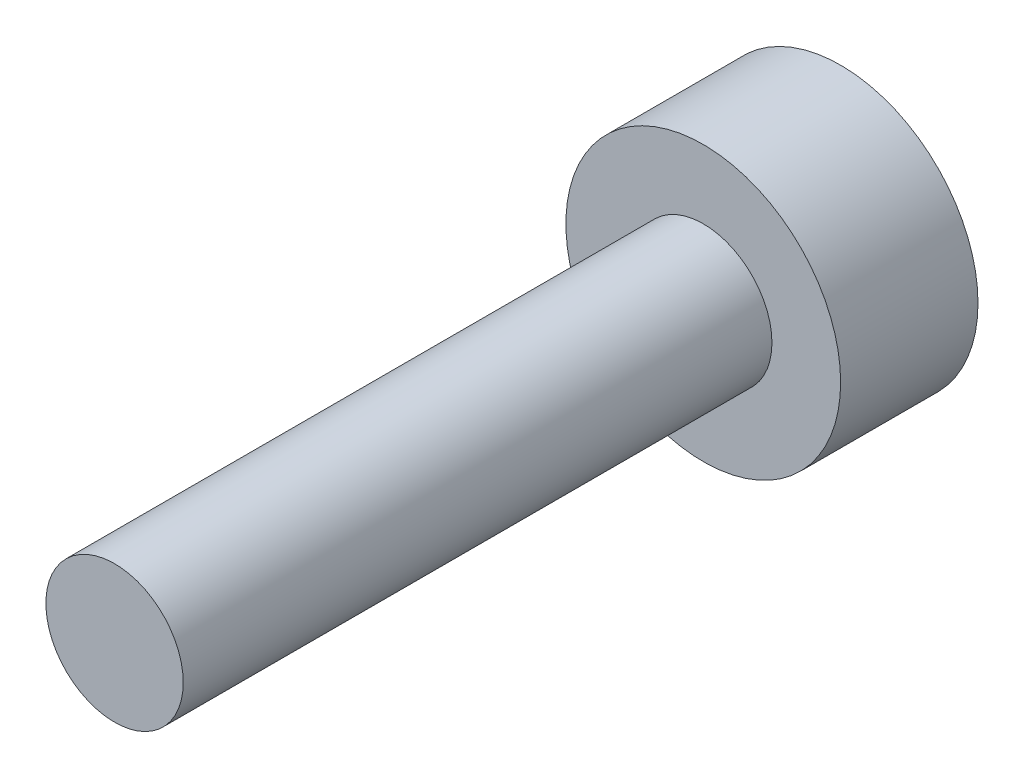
ISO-10303-21;
HEADER;
FILE_DESCRIPTION(('STEP AP214'),'2;1');
FILE_NAME('part.step','',(''),(''),'','','');
FILE_SCHEMA(('AUTOMOTIVE_DESIGN { 1 0 10303 214 1 1 1 1 }'));
ENDSEC;
DATA;
#1=APPLICATION_CONTEXT('core data for automotive mechanical design processes');
#2=APPLICATION_PROTOCOL_DEFINITION('international standard','automotive_design',2000,#1);
#3=PRODUCT_CONTEXT('',#1,'mechanical');
#4=PRODUCT('Part','Part','',(#3));
#5=PRODUCT_RELATED_PRODUCT_CATEGORY('part','',(#4));
#6=PRODUCT_DEFINITION_FORMATION('','',#4);
#7=PRODUCT_DEFINITION_CONTEXT('part definition',#1,'design');
#8=PRODUCT_DEFINITION('design','',#6,#7);
#9=PRODUCT_DEFINITION_SHAPE('','',#8);
#10=(LENGTH_UNIT() NAMED_UNIT(*) SI_UNIT(.MILLI.,.METRE.));
#11=(NAMED_UNIT(*) PLANE_ANGLE_UNIT() SI_UNIT($,.RADIAN.));
#12=(NAMED_UNIT(*) SI_UNIT($,.STERADIAN.) SOLID_ANGLE_UNIT());
#13=UNCERTAINTY_MEASURE_WITH_UNIT(LENGTH_MEASURE(1.E-05),#10,'distance_accuracy_value','');
#14=(GEOMETRIC_REPRESENTATION_CONTEXT(3) GLOBAL_UNCERTAINTY_ASSIGNED_CONTEXT((#13)) GLOBAL_UNIT_ASSIGNED_CONTEXT((#10,
#11,#12)) REPRESENTATION_CONTEXT('',''));
#15=CARTESIAN_POINT('',(0.,0.,0.));
#16=DIRECTION('',(0.,0.,1.));
#17=DIRECTION('',(1.,0.,0.));
#18=AXIS2_PLACEMENT_3D('',#15,#16,#17);
#19=CARTESIAN_POINT('',(0.,0.,11.4));
#20=DIRECTION('',(0.,0.,-1.));
#21=DIRECTION('',(-1.,0.,0.));
#22=AXIS2_PLACEMENT_3D('',#19,#20,#21);
#23=CYLINDRICAL_SURFACE('',#22,0.7);
#24=CARTESIAN_POINT('',(0.,0.,1.4));
#25=DIRECTION('',(0.,0.,1.));
#26=DIRECTION('',(1.,0.,0.));
#27=AXIS2_PLACEMENT_3D('',#24,#25,#26);
#28=CIRCLE('',#27,0.7);
#29=CARTESIAN_POINT('',(0.7,0.,1.4));
#30=VERTEX_POINT('',#29);
#31=EDGE_CURVE('E11',#30,#30,#28,.T.);
#32=ORIENTED_EDGE('',*,*,#31,.T.);
#33=EDGE_LOOP('',(#32));
#34=FACE_BOUND('',#33,.T.);
#35=CARTESIAN_POINT('',(0.,0.,7.4));
#36=DIRECTION('',(0.,0.,1.));
#37=DIRECTION('',(1.,0.,0.));
#38=AXIS2_PLACEMENT_3D('',#35,#36,#37);
#39=CIRCLE('',#38,0.7);
#40=CARTESIAN_POINT('',(0.7,0.,7.4));
#41=VERTEX_POINT('',#40);
#42=EDGE_CURVE('E42',#41,#41,#39,.T.);
#43=ORIENTED_EDGE('',*,*,#42,.F.);
#44=EDGE_LOOP('',(#43));
#45=FACE_BOUND('',#44,.T.);
#46=ADVANCED_FACE('F38',(#34,#45),#23,.T.);
#47=CARTESIAN_POINT('',(0.,0.,1.4));
#48=DIRECTION('',(0.,0.,-1.));
#49=DIRECTION('',(-1.,0.,0.));
#50=AXIS2_PLACEMENT_3D('',#47,#48,#49);
#51=CYLINDRICAL_SURFACE('',#50,1.4);
#52=CARTESIAN_POINT('',(0.,0.,1.4));
#53=DIRECTION('',(0.,0.,1.));
#54=DIRECTION('',(1.,0.,0.));
#55=AXIS2_PLACEMENT_3D('',#52,#53,#54);
#56=CIRCLE('',#55,1.4);
#57=CARTESIAN_POINT('',(1.4,0.,1.4));
#58=VERTEX_POINT('',#57);
#59=EDGE_CURVE('E48',#58,#58,#56,.T.);
#60=ORIENTED_EDGE('',*,*,#59,.F.);
#61=EDGE_LOOP('',(#60));
#62=FACE_BOUND('',#61,.T.);
#63=CARTESIAN_POINT('',(0.,0.,0.));
#64=DIRECTION('',(0.,0.,1.));
#65=DIRECTION('',(1.,0.,0.));
#66=AXIS2_PLACEMENT_3D('',#63,#64,#65);
#67=CIRCLE('',#66,1.4);
#68=CARTESIAN_POINT('',(1.4,0.,0.));
#69=VERTEX_POINT('',#68);
#70=EDGE_CURVE('E155',#69,#69,#67,.T.);
#71=ORIENTED_EDGE('',*,*,#70,.T.);
#72=EDGE_LOOP('',(#71));
#73=FACE_BOUND('',#72,.T.);
#74=ADVANCED_FACE('F40',(#62,#73),#51,.T.);
#75=CARTESIAN_POINT('',(0.,0.,1.4));
#76=DIRECTION('',(0.,0.,1.));
#77=DIRECTION('',(1.,0.,0.));
#78=AXIS2_PLACEMENT_3D('',#75,#76,#77);
#79=PLANE('',#78);
#80=ORIENTED_EDGE('',*,*,#31,.F.);
#81=EDGE_LOOP('',(#80));
#82=FACE_BOUND('',#81,.T.);
#83=ORIENTED_EDGE('',*,*,#59,.T.);
#84=EDGE_LOOP('',(#83));
#85=FACE_BOUND('',#84,.T.);
#86=ADVANCED_FACE('F175',(#82,#85),#79,.T.);
#87=CARTESIAN_POINT('',(0.,0.,0.));
#88=DIRECTION('',(0.,0.,1.));
#89=DIRECTION('',(1.,0.,0.));
#90=AXIS2_PLACEMENT_3D('',#87,#88,#89);
#91=PLANE('',#90);
#92=DIRECTION('',(0.866025403784438,-0.500000000000001,0.));
#93=VECTOR('',#92,1.);
#94=CARTESIAN_POINT('',(0.,0.68,0.));
#95=LINE('',#94,#93);
#96=CARTESIAN_POINT('',(0.,0.68,0.));
#97=VERTEX_POINT('',#96);
#98=CARTESIAN_POINT('',(0.588897274573419,0.339999999999999,0.));
#99=VERTEX_POINT('',#98);
#100=EDGE_CURVE('E136',#97,#99,#95,.T.);
#101=ORIENTED_EDGE('',*,*,#100,.F.);
#102=DIRECTION('',(0.866025403784442,0.499999999999995,0.));
#103=VECTOR('',#102,1.);
#104=CARTESIAN_POINT('',(-0.588897274573414,0.340000000000007,0.));
#105=LINE('',#104,#103);
#106=CARTESIAN_POINT('',(-0.588897274573414,0.340000000000007,0.));
#107=VERTEX_POINT('',#106);
#108=EDGE_CURVE('E56',#107,#97,#105,.T.);
#109=ORIENTED_EDGE('',*,*,#108,.F.);
#110=DIRECTION('',(0.,1.,0.));
#111=VECTOR('',#110,1.);
#112=CARTESIAN_POINT('',(-0.588897274573421,-0.339999999999995,0.));
#113=LINE('',#112,#111);
#114=CARTESIAN_POINT('',(-0.588897274573421,-0.339999999999995,0.));
#115=VERTEX_POINT('',#114);
#116=EDGE_CURVE('E149',#115,#107,#113,.T.);
#117=ORIENTED_EDGE('',*,*,#116,.F.);
#118=DIRECTION('',(-0.866025403784435,0.500000000000007,0.));
#119=VECTOR('',#118,1.);
#120=CARTESIAN_POINT('',(0.,-0.68,0.));
#121=LINE('',#120,#119);
#122=CARTESIAN_POINT('',(0.,-0.68,0.));
#123=VERTEX_POINT('',#122);
#124=EDGE_CURVE('E146',#123,#115,#121,.T.);
#125=ORIENTED_EDGE('',*,*,#124,.F.);
#126=DIRECTION('',(-0.866025403784441,-0.499999999999995,0.));
#127=VECTOR('',#126,1.);
#128=CARTESIAN_POINT('',(0.588897274573417,-0.340000000000003,0.));
#129=LINE('',#128,#127);
#130=CARTESIAN_POINT('',(0.588897274573417,-0.340000000000003,0.));
#131=VERTEX_POINT('',#130);
#132=EDGE_CURVE('E104',#131,#123,#129,.T.);
#133=ORIENTED_EDGE('',*,*,#132,.F.);
#134=DIRECTION('',(0.,-1.,0.));
#135=VECTOR('',#134,1.);
#136=CARTESIAN_POINT('',(0.588897274573419,0.339999999999999,0.));
#137=LINE('',#136,#135);
#138=EDGE_CURVE('E140',#99,#131,#137,.T.);
#139=ORIENTED_EDGE('',*,*,#138,.F.);
#140=EDGE_LOOP('',(#101,#109,#117,#125,#133,#139));
#141=FACE_BOUND('',#140,.T.);
#142=ORIENTED_EDGE('',*,*,#70,.F.);
#143=EDGE_LOOP('',(#142));
#144=FACE_BOUND('',#143,.T.);
#145=ADVANCED_FACE('F172',(#141,#144),#91,.F.);
#146=CARTESIAN_POINT('',(-0.588897274573414,0.340000000000007,1.));
#147=DIRECTION('',(-0.499999999999995,0.866025403784442,0.));
#148=DIRECTION('',(-0.866025403784442,-0.499999999999995,0.));
#149=AXIS2_PLACEMENT_3D('',#146,#147,#148);
#150=PLANE('',#149);
#151=ORIENTED_EDGE('',*,*,#108,.T.);
#152=DIRECTION('',(0.,0.,-1.));
#153=VECTOR('',#152,1.);
#154=CARTESIAN_POINT('',(0.,0.68,1.));
#155=LINE('',#154,#153);
#156=CARTESIAN_POINT('',(0.,0.68,1.));
#157=VERTEX_POINT('',#156);
#158=EDGE_CURVE('E86',#157,#97,#155,.T.);
#159=ORIENTED_EDGE('',*,*,#158,.F.);
#160=DIRECTION('',(0.866025403784442,0.499999999999995,0.));
#161=VECTOR('',#160,1.);
#162=CARTESIAN_POINT('',(-0.588897274573414,0.340000000000007,1.));
#163=LINE('',#162,#161);
#164=CARTESIAN_POINT('',(-0.588897274573414,0.340000000000007,1.));
#165=VERTEX_POINT('',#164);
#166=EDGE_CURVE('E152',#165,#157,#163,.T.);
#167=ORIENTED_EDGE('',*,*,#166,.F.);
#168=DIRECTION('',(0.,0.,-1.));
#169=VECTOR('',#168,1.);
#170=CARTESIAN_POINT('',(-0.588897274573414,0.340000000000007,1.));
#171=LINE('',#170,#169);
#172=EDGE_CURVE('E64',#165,#107,#171,.T.);
#173=ORIENTED_EDGE('',*,*,#172,.T.);
#174=EDGE_LOOP('',(#151,#159,#167,#173));
#175=FACE_BOUND('',#174,.T.);
#176=ADVANCED_FACE('F174',(#175),#150,.F.);
#177=CARTESIAN_POINT('',(-0.588897274573421,-0.339999999999995,1.));
#178=DIRECTION('',(-1.,0.,0.));
#179=DIRECTION('',(0.,-1.,0.));
#180=AXIS2_PLACEMENT_3D('',#177,#178,#179);
#181=PLANE('',#180);
#182=ORIENTED_EDGE('',*,*,#116,.T.);
#183=ORIENTED_EDGE('',*,*,#172,.F.);
#184=DIRECTION('',(0.,1.,0.));
#185=VECTOR('',#184,1.);
#186=CARTESIAN_POINT('',(-0.588897274573421,-0.339999999999995,1.));
#187=LINE('',#186,#185);
#188=CARTESIAN_POINT('',(-0.588897274573421,-0.339999999999995,1.));
#189=VERTEX_POINT('',#188);
#190=EDGE_CURVE('E118',#189,#165,#187,.T.);
#191=ORIENTED_EDGE('',*,*,#190,.F.);
#192=DIRECTION('',(0.,0.,-1.));
#193=VECTOR('',#192,1.);
#194=CARTESIAN_POINT('',(-0.588897274573421,-0.339999999999995,1.));
#195=LINE('',#194,#193);
#196=EDGE_CURVE('E109',#189,#115,#195,.T.);
#197=ORIENTED_EDGE('',*,*,#196,.T.);
#198=EDGE_LOOP('',(#182,#183,#191,#197));
#199=FACE_BOUND('',#198,.T.);
#200=ADVANCED_FACE('F181',(#199),#181,.F.);
#201=CARTESIAN_POINT('',(0.,-0.68,1.));
#202=DIRECTION('',(-0.500000000000007,-0.866025403784435,0.));
#203=DIRECTION('',(0.866025403784435,-0.500000000000007,0.));
#204=AXIS2_PLACEMENT_3D('',#201,#202,#203);
#205=PLANE('',#204);
#206=ORIENTED_EDGE('',*,*,#124,.T.);
#207=ORIENTED_EDGE('',*,*,#196,.F.);
#208=DIRECTION('',(-0.866025403784435,0.500000000000007,0.));
#209=VECTOR('',#208,1.);
#210=CARTESIAN_POINT('',(0.,-0.68,1.));
#211=LINE('',#210,#209);
#212=CARTESIAN_POINT('',(0.,-0.68,1.));
#213=VERTEX_POINT('',#212);
#214=EDGE_CURVE('E113',#213,#189,#211,.T.);
#215=ORIENTED_EDGE('',*,*,#214,.F.);
#216=DIRECTION('',(0.,0.,-1.));
#217=VECTOR('',#216,1.);
#218=CARTESIAN_POINT('',(0.,-0.68,1.));
#219=LINE('',#218,#217);
#220=EDGE_CURVE('E97',#213,#123,#219,.T.);
#221=ORIENTED_EDGE('',*,*,#220,.T.);
#222=EDGE_LOOP('',(#206,#207,#215,#221));
#223=FACE_BOUND('',#222,.T.);
#224=ADVANCED_FACE('F114',(#223),#205,.F.);
#225=CARTESIAN_POINT('',(0.588897274573417,-0.340000000000003,1.));
#226=DIRECTION('',(0.499999999999995,-0.866025403784441,0.));
#227=DIRECTION('',(0.866025403784442,0.499999999999995,0.));
#228=AXIS2_PLACEMENT_3D('',#225,#226,#227);
#229=PLANE('',#228);
#230=ORIENTED_EDGE('',*,*,#132,.T.);
#231=ORIENTED_EDGE('',*,*,#220,.F.);
#232=DIRECTION('',(-0.866025403784441,-0.499999999999995,0.));
#233=VECTOR('',#232,1.);
#234=CARTESIAN_POINT('',(0.588897274573417,-0.340000000000003,1.));
#235=LINE('',#234,#233);
#236=CARTESIAN_POINT('',(0.588897274573417,-0.340000000000003,1.));
#237=VERTEX_POINT('',#236);
#238=EDGE_CURVE('E101',#237,#213,#235,.T.);
#239=ORIENTED_EDGE('',*,*,#238,.F.);
#240=DIRECTION('',(0.,0.,-1.));
#241=VECTOR('',#240,1.);
#242=CARTESIAN_POINT('',(0.588897274573417,-0.340000000000003,1.));
#243=LINE('',#242,#241);
#244=EDGE_CURVE('E110',#237,#131,#243,.T.);
#245=ORIENTED_EDGE('',*,*,#244,.T.);
#246=EDGE_LOOP('',(#230,#231,#239,#245));
#247=FACE_BOUND('',#246,.T.);
#248=ADVANCED_FACE('F99',(#247),#229,.F.);
#249=CARTESIAN_POINT('',(0.588897274573419,0.339999999999999,1.));
#250=DIRECTION('',(1.,0.,0.));
#251=DIRECTION('',(0.,1.,0.));
#252=AXIS2_PLACEMENT_3D('',#249,#250,#251);
#253=PLANE('',#252);
#254=ORIENTED_EDGE('',*,*,#138,.T.);
#255=ORIENTED_EDGE('',*,*,#244,.F.);
#256=DIRECTION('',(0.,-1.,0.));
#257=VECTOR('',#256,1.);
#258=CARTESIAN_POINT('',(0.588897274573419,0.339999999999999,1.));
#259=LINE('',#258,#257);
#260=CARTESIAN_POINT('',(0.588897274573419,0.339999999999999,1.));
#261=VERTEX_POINT('',#260);
#262=EDGE_CURVE('E124',#261,#237,#259,.T.);
#263=ORIENTED_EDGE('',*,*,#262,.F.);
#264=DIRECTION('',(0.,0.,-1.));
#265=VECTOR('',#264,1.);
#266=CARTESIAN_POINT('',(0.588897274573419,0.339999999999999,1.));
#267=LINE('',#266,#265);
#268=EDGE_CURVE('E160',#261,#99,#267,.T.);
#269=ORIENTED_EDGE('',*,*,#268,.T.);
#270=EDGE_LOOP('',(#254,#255,#263,#269));
#271=FACE_BOUND('',#270,.T.);
#272=ADVANCED_FACE('F200',(#271),#253,.F.);
#273=CARTESIAN_POINT('',(0.,0.68,1.));
#274=DIRECTION('',(0.500000000000001,0.866025403784438,0.));
#275=DIRECTION('',(-0.866025403784438,0.500000000000001,0.));
#276=AXIS2_PLACEMENT_3D('',#273,#274,#275);
#277=PLANE('',#276);
#278=ORIENTED_EDGE('',*,*,#100,.T.);
#279=ORIENTED_EDGE('',*,*,#268,.F.);
#280=DIRECTION('',(0.866025403784438,-0.500000000000001,0.));
#281=VECTOR('',#280,1.);
#282=CARTESIAN_POINT('',(0.,0.68,1.));
#283=LINE('',#282,#281);
#284=EDGE_CURVE('E128',#157,#261,#283,.T.);
#285=ORIENTED_EDGE('',*,*,#284,.F.);
#286=ORIENTED_EDGE('',*,*,#158,.T.);
#287=EDGE_LOOP('',(#278,#279,#285,#286));
#288=FACE_BOUND('',#287,.T.);
#289=ADVANCED_FACE('F197',(#288),#277,.F.);
#290=CARTESIAN_POINT('',(0.,0.,1.));
#291=DIRECTION('',(0.,0.,-1.));
#292=DIRECTION('',(-1.,0.,0.));
#293=AXIS2_PLACEMENT_3D('',#290,#291,#292);
#294=PLANE('',#293);
#295=ORIENTED_EDGE('',*,*,#166,.T.);
#296=ORIENTED_EDGE('',*,*,#284,.T.);
#297=ORIENTED_EDGE('',*,*,#262,.T.);
#298=ORIENTED_EDGE('',*,*,#238,.T.);
#299=ORIENTED_EDGE('',*,*,#214,.T.);
#300=ORIENTED_EDGE('',*,*,#190,.T.);
#301=EDGE_LOOP('',(#295,#296,#297,#298,#299,#300));
#302=FACE_BOUND('',#301,.T.);
#303=ADVANCED_FACE('F121',(#302),#294,.T.);
#304=CARTESIAN_POINT('',(0.,0.,7.4));
#305=DIRECTION('',(0.,0.,1.));
#306=DIRECTION('',(1.,0.,0.));
#307=AXIS2_PLACEMENT_3D('',#304,#305,#306);
#308=PLANE('',#307);
#309=ORIENTED_EDGE('',*,*,#42,.T.);
#310=EDGE_LOOP('',(#309));
#311=FACE_BOUND('',#310,.T.);
#312=ADVANCED_FACE('F213',(#311),#308,.T.);
#313=CLOSED_SHELL('',(#46,#74,#86,#145,#176,#200,#224,#248,#272,#289,#303,#312));
#314=MANIFOLD_SOLID_BREP('B2',#313);
#315=ADVANCED_BREP_SHAPE_REPRESENTATION('',(#18,#314),#14);
#316=SHAPE_DEFINITION_REPRESENTATION(#9,#315);
ENDSEC;
END-ISO-10303-21;
